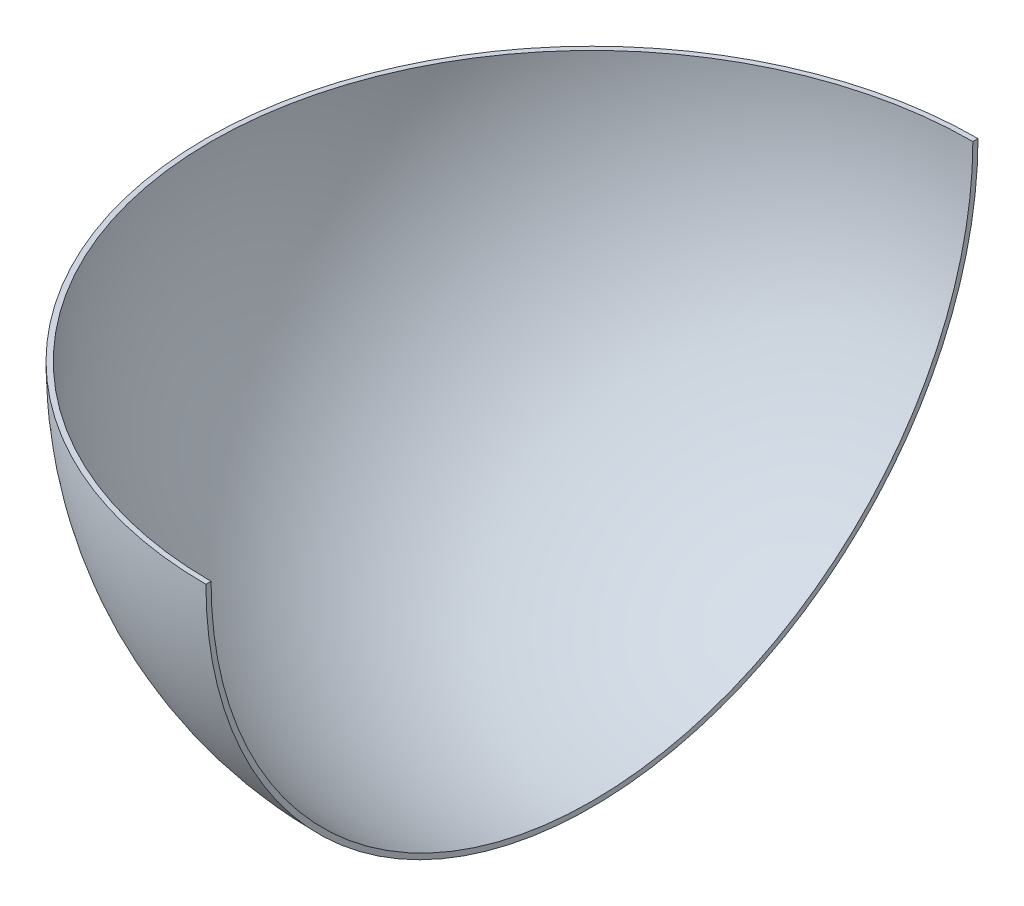
ISO-10303-21;
HEADER;
FILE_DESCRIPTION(('STEP AP214'),'2;1');
FILE_NAME('part.step','',(''),(''),'','','');
FILE_SCHEMA(('AUTOMOTIVE_DESIGN { 1 0 10303 214 1 1 1 1 }'));
ENDSEC;
DATA;
#1=APPLICATION_CONTEXT('core data for automotive mechanical design processes');
#2=APPLICATION_PROTOCOL_DEFINITION('international standard','automotive_design',2000,#1);
#3=PRODUCT_CONTEXT('',#1,'mechanical');
#4=PRODUCT('Part','Part','',(#3));
#5=PRODUCT_RELATED_PRODUCT_CATEGORY('part','',(#4));
#6=PRODUCT_DEFINITION_FORMATION('','',#4);
#7=PRODUCT_DEFINITION_CONTEXT('part definition',#1,'design');
#8=PRODUCT_DEFINITION('design','',#6,#7);
#9=PRODUCT_DEFINITION_SHAPE('','',#8);
#10=(LENGTH_UNIT() NAMED_UNIT(*) SI_UNIT(.MILLI.,.METRE.));
#11=(NAMED_UNIT(*) PLANE_ANGLE_UNIT() SI_UNIT($,.RADIAN.));
#12=(NAMED_UNIT(*) SI_UNIT($,.STERADIAN.) SOLID_ANGLE_UNIT());
#13=UNCERTAINTY_MEASURE_WITH_UNIT(LENGTH_MEASURE(1.E-05),#10,'distance_accuracy_value','');
#14=(GEOMETRIC_REPRESENTATION_CONTEXT(3) GLOBAL_UNCERTAINTY_ASSIGNED_CONTEXT((#13)) GLOBAL_UNIT_ASSIGNED_CONTEXT((#10,
#11,#12)) REPRESENTATION_CONTEXT('',''));
#15=CARTESIAN_POINT('',(0.,0.,0.));
#16=DIRECTION('',(0.,0.,1.));
#17=DIRECTION('',(1.,0.,0.));
#18=AXIS2_PLACEMENT_3D('',#15,#16,#17);
#19=CARTESIAN_POINT('',(0.,0.,0.));
#20=DIRECTION('',(-1.,0.,0.));
#21=DIRECTION('',(0.,0.,-1.));
#22=AXIS2_PLACEMENT_3D('',#19,#20,#21);
#23=SPHERICAL_SURFACE('',#22,148.);
#24=CARTESIAN_POINT('',(0.,0.,0.));
#25=DIRECTION('',(0.,1.,0.));
#26=DIRECTION('',(1.,0.,0.));
#27=AXIS2_PLACEMENT_3D('',#24,#25,#26);
#28=CIRCLE('',#27,148.);
#29=CARTESIAN_POINT('',(0.,-4.47923968355355E-13,-148.));
#30=VERTEX_POINT('',#29);
#31=CARTESIAN_POINT('',(0.,-5.16739238148784E-13,148.));
#32=VERTEX_POINT('',#31);
#33=EDGE_CURVE('E74',#30,#32,#28,.T.);
#34=ORIENTED_EDGE('',*,*,#33,.T.);
#35=CARTESIAN_POINT('',(0.,0.,0.));
#36=DIRECTION('',(1.,0.,0.));
#37=DIRECTION('',(0.,0.,-1.));
#38=AXIS2_PLACEMENT_3D('',#35,#36,#37);
#39=CIRCLE('',#38,148.);
#40=EDGE_CURVE('E53',#32,#30,#39,.T.);
#41=ORIENTED_EDGE('',*,*,#40,.T.);
#42=EDGE_LOOP('',(#34,#41));
#43=FACE_BOUND('',#42,.T.);
#44=ADVANCED_FACE('F38',(#43),#23,.F.);
#45=CARTESIAN_POINT('',(0.,0.,0.));
#46=DIRECTION('',(-1.,0.,0.));
#47=DIRECTION('',(0.,0.,1.));
#48=AXIS2_PLACEMENT_3D('',#45,#46,#47);
#49=SPHERICAL_SURFACE('',#48,150.);
#50=CARTESIAN_POINT('',(0.,0.,0.));
#51=DIRECTION('',(0.,-1.,0.));
#52=DIRECTION('',(1.,0.,0.));
#53=AXIS2_PLACEMENT_3D('',#50,#51,#52);
#54=CIRCLE('',#53,150.);
#55=CARTESIAN_POINT('',(0.,-4.47923968355355E-13,150.));
#56=VERTEX_POINT('',#55);
#57=CARTESIAN_POINT('',(0.,-4.47923968355355E-13,-150.));
#58=VERTEX_POINT('',#57);
#59=EDGE_CURVE('E47',#56,#58,#54,.T.);
#60=ORIENTED_EDGE('',*,*,#59,.T.);
#61=CARTESIAN_POINT('',(0.,0.,0.));
#62=DIRECTION('',(1.,0.,0.));
#63=DIRECTION('',(0.,0.,-1.));
#64=AXIS2_PLACEMENT_3D('',#61,#62,#63);
#65=CIRCLE('',#64,150.);
#66=EDGE_CURVE('E63',#58,#56,#65,.F.);
#67=ORIENTED_EDGE('',*,*,#66,.T.);
#68=EDGE_LOOP('',(#60,#67));
#69=FACE_BOUND('',#68,.T.);
#70=ADVANCED_FACE('F40',(#69),#49,.T.);
#71=CARTESIAN_POINT('',(0.,0.,0.));
#72=DIRECTION('',(0.,-1.,0.));
#73=DIRECTION('',(1.,0.,0.));
#74=AXIS2_PLACEMENT_3D('',#71,#72,#73);
#75=PLANE('',#74);
#76=DIRECTION('',(0.,0.,1.));
#77=VECTOR('',#76,1.);
#78=CARTESIAN_POINT('',(0.,-4.47923968355355E-13,150.));
#79=LINE('',#78,#77);
#80=EDGE_CURVE('E58',#58,#30,#79,.T.);
#81=ORIENTED_EDGE('',*,*,#80,.F.);
#82=ORIENTED_EDGE('',*,*,#59,.F.);
#83=DIRECTION('',(0.,0.,1.));
#84=VECTOR('',#83,1.);
#85=CARTESIAN_POINT('',(0.,0.,0.));
#86=LINE('',#85,#84);
#87=EDGE_CURVE('E11',#32,#56,#86,.T.);
#88=ORIENTED_EDGE('',*,*,#87,.F.);
#89=ORIENTED_EDGE('',*,*,#33,.F.);
#90=EDGE_LOOP('',(#81,#82,#88,#89));
#91=FACE_BOUND('',#90,.T.);
#92=ADVANCED_FACE('F72',(#91),#75,.F.);
#93=CARTESIAN_POINT('',(0.,0.,0.));
#94=DIRECTION('',(1.,0.,0.));
#95=DIRECTION('',(0.,0.,-1.));
#96=AXIS2_PLACEMENT_3D('',#93,#94,#95);
#97=PLANE('',#96);
#98=ORIENTED_EDGE('',*,*,#87,.T.);
#99=ORIENTED_EDGE('',*,*,#66,.F.);
#100=ORIENTED_EDGE('',*,*,#80,.T.);
#101=ORIENTED_EDGE('',*,*,#40,.F.);
#102=EDGE_LOOP('',(#98,#99,#100,#101));
#103=FACE_BOUND('',#102,.T.);
#104=ADVANCED_FACE('F64',(#103),#97,.T.);
#105=CLOSED_SHELL('',(#44,#70,#92,#104));
#106=MANIFOLD_SOLID_BREP('B2',#105);
#107=ADVANCED_BREP_SHAPE_REPRESENTATION('',(#18,#106),#14);
#108=SHAPE_DEFINITION_REPRESENTATION(#9,#107);
ENDSEC;
END-ISO-10303-21;
